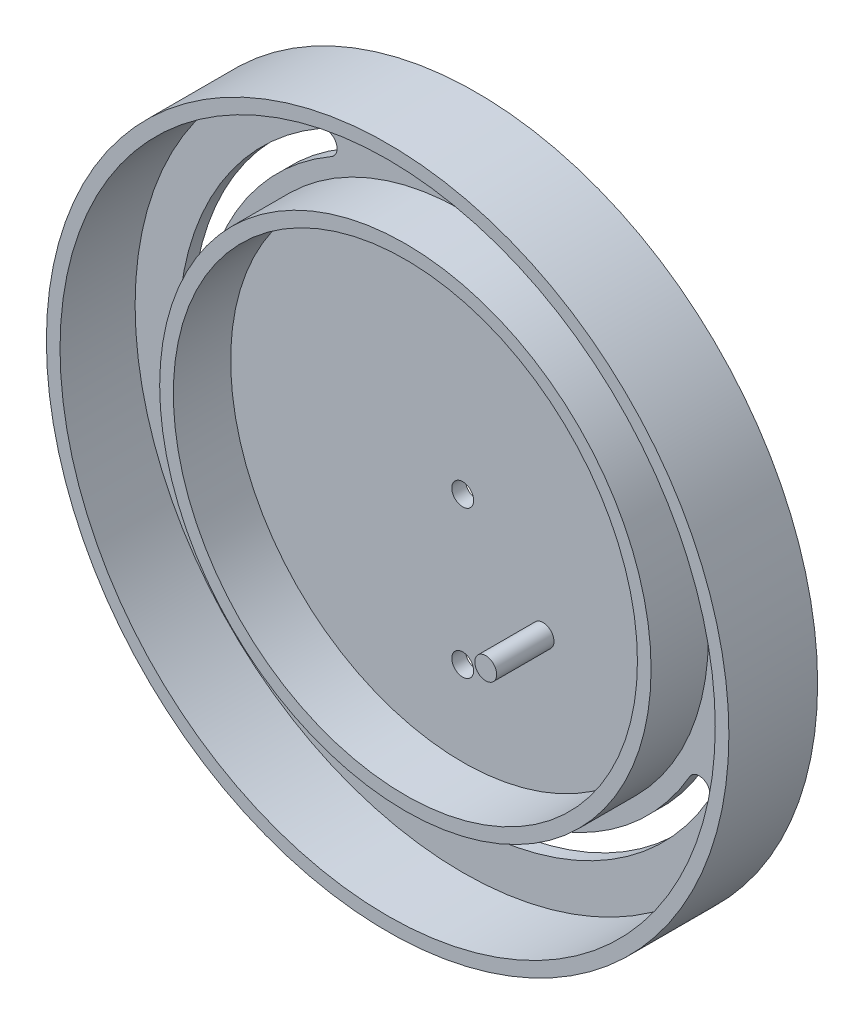
ISO-10303-21;
HEADER;
FILE_DESCRIPTION(('STEP AP214'),'2;1');
FILE_NAME('part.step','',(''),(''),'','','');
FILE_SCHEMA(('AUTOMOTIVE_DESIGN { 1 0 10303 214 1 1 1 1 }'));
ENDSEC;
DATA;
#1=APPLICATION_CONTEXT('core data for automotive mechanical design processes');
#2=APPLICATION_PROTOCOL_DEFINITION('international standard','automotive_design',2000,#1);
#3=PRODUCT_CONTEXT('',#1,'mechanical');
#4=PRODUCT('Part','Part','',(#3));
#5=PRODUCT_RELATED_PRODUCT_CATEGORY('part','',(#4));
#6=PRODUCT_DEFINITION_FORMATION('','',#4);
#7=PRODUCT_DEFINITION_CONTEXT('part definition',#1,'design');
#8=PRODUCT_DEFINITION('design','',#6,#7);
#9=PRODUCT_DEFINITION_SHAPE('','',#8);
#10=(LENGTH_UNIT() NAMED_UNIT(*) SI_UNIT(.MILLI.,.METRE.));
#11=(NAMED_UNIT(*) PLANE_ANGLE_UNIT() SI_UNIT($,.RADIAN.));
#12=(NAMED_UNIT(*) SI_UNIT($,.STERADIAN.) SOLID_ANGLE_UNIT());
#13=UNCERTAINTY_MEASURE_WITH_UNIT(LENGTH_MEASURE(1.E-05),#10,'distance_accuracy_value','');
#14=(GEOMETRIC_REPRESENTATION_CONTEXT(3) GLOBAL_UNCERTAINTY_ASSIGNED_CONTEXT((#13)) GLOBAL_UNIT_ASSIGNED_CONTEXT((#10,
#11,#12)) REPRESENTATION_CONTEXT('',''));
#15=CARTESIAN_POINT('',(0.,0.,0.));
#16=DIRECTION('',(0.,0.,1.));
#17=DIRECTION('',(1.,0.,0.));
#18=AXIS2_PLACEMENT_3D('',#15,#16,#17);
#19=CARTESIAN_POINT('',(0.,0.,1.25));
#20=DIRECTION('',(0.,0.,1.));
#21=DIRECTION('',(1.,0.,0.));
#22=AXIS2_PLACEMENT_3D('',#19,#20,#21);
#23=PLANE('',#22);
#24=CARTESIAN_POINT('',(0.,-27.,1.25));
#25=DIRECTION('',(0.,0.,1.));
#26=DIRECTION('',(1.,0.,0.));
#27=AXIS2_PLACEMENT_3D('',#24,#25,#26);
#28=CIRCLE('',#27,2.);
#29=CARTESIAN_POINT('',(2.,-27.,1.25));
#30=VERTEX_POINT('',#29);
#31=EDGE_CURVE('E218',#30,#30,#28,.T.);
#32=ORIENTED_EDGE('',*,*,#31,.F.);
#33=EDGE_LOOP('',(#32));
#34=FACE_BOUND('',#33,.T.);
#35=CARTESIAN_POINT('',(0.,0.,1.25));
#36=DIRECTION('',(0.,0.,1.));
#37=DIRECTION('',(1.,0.,0.));
#38=AXIS2_PLACEMENT_3D('',#35,#36,#37);
#39=CIRCLE('',#38,2.);
#40=CARTESIAN_POINT('',(2.,0.,1.25));
#41=VERTEX_POINT('',#40);
#42=EDGE_CURVE('E215',#41,#41,#39,.T.);
#43=ORIENTED_EDGE('',*,*,#42,.F.);
#44=EDGE_LOOP('',(#43));
#45=FACE_BOUND('',#44,.T.);
#46=CARTESIAN_POINT('',(14.7158150511627,-14.9814814814815,1.25));
#47=DIRECTION('',(0.,0.,1.));
#48=DIRECTION('',(1.,0.,0.));
#49=AXIS2_PLACEMENT_3D('',#46,#47,#48);
#50=CIRCLE('',#49,2.);
#51=CARTESIAN_POINT('',(16.7158150511627,-14.9814814814815,1.25));
#52=VERTEX_POINT('',#51);
#53=EDGE_CURVE('E181',#52,#52,#50,.F.);
#54=ORIENTED_EDGE('',*,*,#53,.T.);
#55=EDGE_LOOP('',(#54));
#56=FACE_BOUND('',#55,.T.);
#57=CARTESIAN_POINT('',(0.,0.,1.25));
#58=DIRECTION('',(0.,0.,1.));
#59=DIRECTION('',(1.,0.,0.));
#60=AXIS2_PLACEMENT_3D('',#57,#58,#59);
#61=CIRCLE('',#60,42.5);
#62=CARTESIAN_POINT('',(42.5,0.,1.25));
#63=VERTEX_POINT('',#62);
#64=EDGE_CURVE('E12',#63,#63,#61,.F.);
#65=ORIENTED_EDGE('',*,*,#64,.F.);
#66=EDGE_LOOP('',(#65));
#67=FACE_BOUND('',#66,.T.);
#68=ADVANCED_FACE('F67',(#34,#45,#56,#67),#23,.T.);
#69=CARTESIAN_POINT('',(0.,50.,-1.25));
#70=DIRECTION('',(0.,0.,1.));
#71=DIRECTION('',(1.,0.,0.));
#72=AXIS2_PLACEMENT_3D('',#69,#70,#71);
#73=CYLINDRICAL_SURFACE('',#72,2.);
#74=DIRECTION('',(0.,0.,1.));
#75=VECTOR('',#74,1.);
#76=CARTESIAN_POINT('',(0.,52.,-1.25));
#77=LINE('',#76,#75);
#78=CARTESIAN_POINT('',(0.,52.,-1.25));
#79=VERTEX_POINT('',#78);
#80=CARTESIAN_POINT('',(0.,52.,1.25));
#81=VERTEX_POINT('',#80);
#82=EDGE_CURVE('E254',#79,#81,#77,.T.);
#83=ORIENTED_EDGE('',*,*,#82,.T.);
#84=CARTESIAN_POINT('',(0.,50.,1.25));
#85=DIRECTION('',(0.,0.,1.));
#86=DIRECTION('',(1.,0.,0.));
#87=AXIS2_PLACEMENT_3D('',#84,#85,#86);
#88=CIRCLE('',#87,2.);
#89=CARTESIAN_POINT('',(0.,48.,1.25));
#90=VERTEX_POINT('',#89);
#91=EDGE_CURVE('E203',#81,#90,#88,.T.);
#92=ORIENTED_EDGE('',*,*,#91,.T.);
#93=DIRECTION('',(0.,0.,1.));
#94=VECTOR('',#93,1.);
#95=CARTESIAN_POINT('',(0.,48.,-1.25));
#96=LINE('',#95,#94);
#97=CARTESIAN_POINT('',(0.,48.,-1.25));
#98=VERTEX_POINT('',#97);
#99=EDGE_CURVE('E76',#98,#90,#96,.T.);
#100=ORIENTED_EDGE('',*,*,#99,.F.);
#101=CARTESIAN_POINT('',(0.,50.,-1.25));
#102=DIRECTION('',(0.,0.,1.));
#103=DIRECTION('',(1.,0.,0.));
#104=AXIS2_PLACEMENT_3D('',#101,#102,#103);
#105=CIRCLE('',#104,2.);
#106=EDGE_CURVE('E83',#79,#98,#105,.T.);
#107=ORIENTED_EDGE('',*,*,#106,.F.);
#108=EDGE_LOOP('',(#83,#92,#100,#107));
#109=FACE_BOUND('',#108,.T.);
#110=ADVANCED_FACE('F310',(#109),#73,.F.);
#111=CARTESIAN_POINT('',(0.,0.,-1.25));
#112=DIRECTION('',(0.,0.,1.));
#113=DIRECTION('',(1.,0.,0.));
#114=AXIS2_PLACEMENT_3D('',#111,#112,#113);
#115=CYLINDRICAL_SURFACE('',#114,48.);
#116=ORIENTED_EDGE('',*,*,#99,.T.);
#117=CARTESIAN_POINT('',(0.,0.,1.25));
#118=DIRECTION('',(0.,0.,1.));
#119=DIRECTION('',(1.,0.,0.));
#120=AXIS2_PLACEMENT_3D('',#117,#118,#119);
#121=CIRCLE('',#120,48.);
#122=CARTESIAN_POINT('',(48.,0.,1.25));
#123=VERTEX_POINT('',#122);
#124=EDGE_CURVE('E212',#123,#90,#121,.T.);
#125=ORIENTED_EDGE('',*,*,#124,.F.);
#126=DIRECTION('',(0.,0.,1.));
#127=VECTOR('',#126,1.);
#128=CARTESIAN_POINT('',(48.,0.,-1.25));
#129=LINE('',#128,#127);
#130=CARTESIAN_POINT('',(48.,0.,-1.25));
#131=VERTEX_POINT('',#130);
#132=EDGE_CURVE('E91',#131,#123,#129,.T.);
#133=ORIENTED_EDGE('',*,*,#132,.F.);
#134=CARTESIAN_POINT('',(0.,0.,-1.25));
#135=DIRECTION('',(0.,0.,1.));
#136=DIRECTION('',(1.,0.,0.));
#137=AXIS2_PLACEMENT_3D('',#134,#135,#136);
#138=CIRCLE('',#137,48.);
#139=EDGE_CURVE('E243',#131,#98,#138,.T.);
#140=ORIENTED_EDGE('',*,*,#139,.T.);
#141=EDGE_LOOP('',(#116,#125,#133,#140));
#142=FACE_BOUND('',#141,.T.);
#143=ADVANCED_FACE('F316',(#142),#115,.T.);
#144=CARTESIAN_POINT('',(50.,0.,-1.25));
#145=DIRECTION('',(0.,0.,1.));
#146=DIRECTION('',(1.,0.,0.));
#147=AXIS2_PLACEMENT_3D('',#144,#145,#146);
#148=CYLINDRICAL_SURFACE('',#147,2.);
#149=ORIENTED_EDGE('',*,*,#132,.T.);
#150=CARTESIAN_POINT('',(50.,0.,1.25));
#151=DIRECTION('',(0.,0.,1.));
#152=DIRECTION('',(1.,0.,0.));
#153=AXIS2_PLACEMENT_3D('',#150,#151,#152);
#154=CIRCLE('',#153,2.);
#155=CARTESIAN_POINT('',(52.,0.,1.25));
#156=VERTEX_POINT('',#155);
#157=EDGE_CURVE('E209',#123,#156,#154,.T.);
#158=ORIENTED_EDGE('',*,*,#157,.T.);
#159=DIRECTION('',(0.,0.,1.));
#160=VECTOR('',#159,1.);
#161=CARTESIAN_POINT('',(52.,0.,-1.25));
#162=LINE('',#161,#160);
#163=CARTESIAN_POINT('',(52.,0.,-1.25));
#164=VERTEX_POINT('',#163);
#165=EDGE_CURVE('E252',#164,#156,#162,.T.);
#166=ORIENTED_EDGE('',*,*,#165,.F.);
#167=CARTESIAN_POINT('',(50.,0.,-1.25));
#168=DIRECTION('',(0.,0.,1.));
#169=DIRECTION('',(1.,0.,0.));
#170=AXIS2_PLACEMENT_3D('',#167,#168,#169);
#171=CIRCLE('',#170,2.);
#172=EDGE_CURVE('E241',#131,#164,#171,.T.);
#173=ORIENTED_EDGE('',*,*,#172,.F.);
#174=EDGE_LOOP('',(#149,#158,#166,#173));
#175=FACE_BOUND('',#174,.T.);
#176=ADVANCED_FACE('F481',(#175),#148,.F.);
#177=CARTESIAN_POINT('',(43.3012701892219,-25.,-1.25));
#178=DIRECTION('',(0.,0.,1.));
#179=DIRECTION('',(1.,0.,0.));
#180=AXIS2_PLACEMENT_3D('',#177,#178,#179);
#181=CYLINDRICAL_SURFACE('',#180,2.);
#182=DIRECTION('',(0.,0.,1.));
#183=VECTOR('',#182,1.);
#184=CARTESIAN_POINT('',(45.0333209967908,-26.,-1.25));
#185=LINE('',#184,#183);
#186=CARTESIAN_POINT('',(45.0333209967908,-26.,-1.25));
#187=VERTEX_POINT('',#186);
#188=CARTESIAN_POINT('',(45.0333209967908,-26.,1.25));
#189=VERTEX_POINT('',#188);
#190=EDGE_CURVE('E262',#187,#189,#185,.T.);
#191=ORIENTED_EDGE('',*,*,#190,.T.);
#192=CARTESIAN_POINT('',(43.3012701892219,-25.,1.25));
#193=DIRECTION('',(0.,0.,1.));
#194=DIRECTION('',(1.,0.,0.));
#195=AXIS2_PLACEMENT_3D('',#192,#193,#194);
#196=CIRCLE('',#195,2.);
#197=CARTESIAN_POINT('',(41.569219381653,-24.,1.25));
#198=VERTEX_POINT('',#197);
#199=EDGE_CURVE('E191',#189,#198,#196,.T.);
#200=ORIENTED_EDGE('',*,*,#199,.T.);
#201=DIRECTION('',(0.,0.,1.));
#202=VECTOR('',#201,1.);
#203=CARTESIAN_POINT('',(41.569219381653,-24.,-1.25));
#204=LINE('',#203,#202);
#205=CARTESIAN_POINT('',(41.569219381653,-24.,-1.25));
#206=VERTEX_POINT('',#205);
#207=EDGE_CURVE('E256',#206,#198,#204,.T.);
#208=ORIENTED_EDGE('',*,*,#207,.F.);
#209=CARTESIAN_POINT('',(43.3012701892219,-25.,-1.25));
#210=DIRECTION('',(0.,0.,1.));
#211=DIRECTION('',(1.,0.,0.));
#212=AXIS2_PLACEMENT_3D('',#209,#210,#211);
#213=CIRCLE('',#212,2.);
#214=EDGE_CURVE('E229',#187,#206,#213,.T.);
#215=ORIENTED_EDGE('',*,*,#214,.F.);
#216=EDGE_LOOP('',(#191,#200,#208,#215));
#217=FACE_BOUND('',#216,.T.);
#218=ADVANCED_FACE('F473',(#217),#181,.F.);
#219=CARTESIAN_POINT('',(0.,0.,-1.25));
#220=DIRECTION('',(0.,0.,1.));
#221=DIRECTION('',(1.,0.,0.));
#222=AXIS2_PLACEMENT_3D('',#219,#220,#221);
#223=CYLINDRICAL_SURFACE('',#222,48.);
#224=ORIENTED_EDGE('',*,*,#207,.T.);
#225=CARTESIAN_POINT('',(0.,0.,1.25));
#226=DIRECTION('',(0.,0.,1.));
#227=DIRECTION('',(1.,0.,0.));
#228=AXIS2_PLACEMENT_3D('',#225,#226,#227);
#229=CIRCLE('',#228,48.);
#230=CARTESIAN_POINT('',(-24.,-41.569219381653,1.25));
#231=VERTEX_POINT('',#230);
#232=EDGE_CURVE('E200',#231,#198,#229,.T.);
#233=ORIENTED_EDGE('',*,*,#232,.F.);
#234=DIRECTION('',(0.,0.,1.));
#235=VECTOR('',#234,1.);
#236=CARTESIAN_POINT('',(-24.,-41.569219381653,-1.25));
#237=LINE('',#236,#235);
#238=CARTESIAN_POINT('',(-24.,-41.569219381653,-1.25));
#239=VERTEX_POINT('',#238);
#240=EDGE_CURVE('E258',#239,#231,#237,.T.);
#241=ORIENTED_EDGE('',*,*,#240,.F.);
#242=CARTESIAN_POINT('',(0.,0.,-1.25));
#243=DIRECTION('',(0.,0.,1.));
#244=DIRECTION('',(1.,0.,0.));
#245=AXIS2_PLACEMENT_3D('',#242,#243,#244);
#246=CIRCLE('',#245,48.);
#247=EDGE_CURVE('E235',#239,#206,#246,.T.);
#248=ORIENTED_EDGE('',*,*,#247,.T.);
#249=EDGE_LOOP('',(#224,#233,#241,#248));
#250=FACE_BOUND('',#249,.T.);
#251=ADVANCED_FACE('F465',(#250),#223,.T.);
#252=CARTESIAN_POINT('',(-25.,-43.3012701892219,-1.25));
#253=DIRECTION('',(0.,0.,1.));
#254=DIRECTION('',(1.,0.,0.));
#255=AXIS2_PLACEMENT_3D('',#252,#253,#254);
#256=CYLINDRICAL_SURFACE('',#255,1.99999999999999);
#257=ORIENTED_EDGE('',*,*,#240,.T.);
#258=CARTESIAN_POINT('',(-25.,-43.3012701892219,1.25));
#259=DIRECTION('',(0.,0.,1.));
#260=DIRECTION('',(1.,0.,0.));
#261=AXIS2_PLACEMENT_3D('',#258,#259,#260);
#262=CIRCLE('',#261,1.99999999999999);
#263=CARTESIAN_POINT('',(-26.,-45.0333209967907,1.25));
#264=VERTEX_POINT('',#263);
#265=EDGE_CURVE('E197',#231,#264,#262,.T.);
#266=ORIENTED_EDGE('',*,*,#265,.T.);
#267=DIRECTION('',(0.,0.,1.));
#268=VECTOR('',#267,1.);
#269=CARTESIAN_POINT('',(-26.,-45.0333209967907,-1.25));
#270=LINE('',#269,#268);
#271=CARTESIAN_POINT('',(-26.,-45.0333209967907,-1.25));
#272=VERTEX_POINT('',#271);
#273=EDGE_CURVE('E260',#272,#264,#270,.T.);
#274=ORIENTED_EDGE('',*,*,#273,.F.);
#275=CARTESIAN_POINT('',(-25.,-43.3012701892219,-1.25));
#276=DIRECTION('',(0.,0.,1.));
#277=DIRECTION('',(1.,0.,0.));
#278=AXIS2_PLACEMENT_3D('',#275,#276,#277);
#279=CIRCLE('',#278,1.99999999999999);
#280=EDGE_CURVE('E233',#239,#272,#279,.T.);
#281=ORIENTED_EDGE('',*,*,#280,.F.);
#282=EDGE_LOOP('',(#257,#266,#274,#281));
#283=FACE_BOUND('',#282,.T.);
#284=ADVANCED_FACE('F459',(#283),#256,.F.);
#285=CARTESIAN_POINT('',(-43.3012701892219,-24.9999999999999,-1.25));
#286=DIRECTION('',(0.,0.,1.));
#287=DIRECTION('',(1.,0.,0.));
#288=AXIS2_PLACEMENT_3D('',#285,#286,#287);
#289=CYLINDRICAL_SURFACE('',#288,2.);
#290=DIRECTION('',(0.,0.,1.));
#291=VECTOR('',#290,1.);
#292=CARTESIAN_POINT('',(-45.0333209967908,-25.9999999999999,-1.25));
#293=LINE('',#292,#291);
#294=CARTESIAN_POINT('',(-45.0333209967908,-25.9999999999999,-1.25));
#295=VERTEX_POINT('',#294);
#296=CARTESIAN_POINT('',(-45.0333209967908,-25.9999999999999,1.25));
#297=VERTEX_POINT('',#296);
#298=EDGE_CURVE('E160',#295,#297,#293,.T.);
#299=ORIENTED_EDGE('',*,*,#298,.T.);
#300=CARTESIAN_POINT('',(-43.3012701892219,-24.9999999999999,1.25));
#301=DIRECTION('',(0.,0.,1.));
#302=DIRECTION('',(1.,0.,0.));
#303=AXIS2_PLACEMENT_3D('',#300,#301,#302);
#304=CIRCLE('',#303,2.);
#305=CARTESIAN_POINT('',(-41.5692193816531,-23.9999999999999,1.25));
#306=VERTEX_POINT('',#305);
#307=EDGE_CURVE('E163',#297,#306,#304,.T.);
#308=ORIENTED_EDGE('',*,*,#307,.T.);
#309=DIRECTION('',(0.,0.,1.));
#310=VECTOR('',#309,1.);
#311=CARTESIAN_POINT('',(-41.5692193816531,-23.9999999999999,-1.25));
#312=LINE('',#311,#310);
#313=CARTESIAN_POINT('',(-41.5692193816531,-23.9999999999999,-1.25));
#314=VERTEX_POINT('',#313);
#315=EDGE_CURVE('E264',#314,#306,#312,.T.);
#316=ORIENTED_EDGE('',*,*,#315,.F.);
#317=CARTESIAN_POINT('',(-43.3012701892219,-24.9999999999999,-1.25));
#318=DIRECTION('',(0.,0.,1.));
#319=DIRECTION('',(1.,0.,0.));
#320=AXIS2_PLACEMENT_3D('',#317,#318,#319);
#321=CIRCLE('',#320,2.);
#322=EDGE_CURVE('E164',#295,#314,#321,.T.);
#323=ORIENTED_EDGE('',*,*,#322,.F.);
#324=EDGE_LOOP('',(#299,#308,#316,#323));
#325=FACE_BOUND('',#324,.T.);
#326=ADVANCED_FACE('F69',(#325),#289,.F.);
#327=CARTESIAN_POINT('',(0.,0.,-1.25));
#328=DIRECTION('',(0.,0.,1.));
#329=DIRECTION('',(1.,0.,0.));
#330=AXIS2_PLACEMENT_3D('',#327,#328,#329);
#331=CYLINDRICAL_SURFACE('',#330,48.);
#332=ORIENTED_EDGE('',*,*,#315,.T.);
#333=CARTESIAN_POINT('',(0.,0.,1.25));
#334=DIRECTION('',(0.,0.,1.));
#335=DIRECTION('',(1.,0.,0.));
#336=AXIS2_PLACEMENT_3D('',#333,#334,#335);
#337=CIRCLE('',#336,48.);
#338=CARTESIAN_POINT('',(-23.9999999999999,41.5692193816531,1.25));
#339=VERTEX_POINT('',#338);
#340=EDGE_CURVE('E180',#339,#306,#337,.T.);
#341=ORIENTED_EDGE('',*,*,#340,.F.);
#342=DIRECTION('',(0.,0.,1.));
#343=VECTOR('',#342,1.);
#344=CARTESIAN_POINT('',(-23.9999999999999,41.5692193816531,-1.25));
#345=LINE('',#344,#343);
#346=CARTESIAN_POINT('',(-23.9999999999999,41.5692193816531,-1.25));
#347=VERTEX_POINT('',#346);
#348=EDGE_CURVE('E266',#347,#339,#345,.T.);
#349=ORIENTED_EDGE('',*,*,#348,.F.);
#350=CARTESIAN_POINT('',(0.,0.,-1.25));
#351=DIRECTION('',(0.,0.,1.));
#352=DIRECTION('',(1.,0.,0.));
#353=AXIS2_PLACEMENT_3D('',#350,#351,#352);
#354=CIRCLE('',#353,48.);
#355=EDGE_CURVE('E226',#347,#314,#354,.T.);
#356=ORIENTED_EDGE('',*,*,#355,.T.);
#357=EDGE_LOOP('',(#332,#341,#349,#356));
#358=FACE_BOUND('',#357,.T.);
#359=ADVANCED_FACE('F444',(#358),#331,.T.);
#360=CARTESIAN_POINT('',(-24.9999999999999,43.301270189222,-1.25));
#361=DIRECTION('',(0.,0.,1.));
#362=DIRECTION('',(1.,0.,0.));
#363=AXIS2_PLACEMENT_3D('',#360,#361,#362);
#364=CYLINDRICAL_SURFACE('',#363,1.99999999999999);
#365=ORIENTED_EDGE('',*,*,#348,.T.);
#366=CARTESIAN_POINT('',(-24.9999999999999,43.301270189222,1.25));
#367=DIRECTION('',(0.,0.,1.));
#368=DIRECTION('',(1.,0.,0.));
#369=AXIS2_PLACEMENT_3D('',#366,#367,#368);
#370=CIRCLE('',#369,1.99999999999999);
#371=CARTESIAN_POINT('',(-25.9999999999999,45.0333209967908,1.25));
#372=VERTEX_POINT('',#371);
#373=EDGE_CURVE('E185',#339,#372,#370,.T.);
#374=ORIENTED_EDGE('',*,*,#373,.T.);
#375=DIRECTION('',(0.,0.,1.));
#376=VECTOR('',#375,1.);
#377=CARTESIAN_POINT('',(-25.9999999999999,45.0333209967908,-1.25));
#378=LINE('',#377,#376);
#379=CARTESIAN_POINT('',(-25.9999999999999,45.0333209967908,-1.25));
#380=VERTEX_POINT('',#379);
#381=EDGE_CURVE('E168',#380,#372,#378,.T.);
#382=ORIENTED_EDGE('',*,*,#381,.F.);
#383=CARTESIAN_POINT('',(-24.9999999999999,43.301270189222,-1.25));
#384=DIRECTION('',(0.,0.,1.));
#385=DIRECTION('',(1.,0.,0.));
#386=AXIS2_PLACEMENT_3D('',#383,#384,#385);
#387=CIRCLE('',#386,1.99999999999999);
#388=EDGE_CURVE('E224',#347,#380,#387,.T.);
#389=ORIENTED_EDGE('',*,*,#388,.F.);
#390=EDGE_LOOP('',(#365,#374,#382,#389));
#391=FACE_BOUND('',#390,.T.);
#392=ADVANCED_FACE('F436',(#391),#364,.F.);
#393=CARTESIAN_POINT('',(0.,0.,-1.25));
#394=DIRECTION('',(0.,0.,1.));
#395=DIRECTION('',(1.,0.,0.));
#396=AXIS2_PLACEMENT_3D('',#393,#394,#395);
#397=CYLINDRICAL_SURFACE('',#396,2.);
#398=CARTESIAN_POINT('',(0.,0.,-1.25));
#399=DIRECTION('',(0.,0.,1.));
#400=DIRECTION('',(1.,0.,0.));
#401=AXIS2_PLACEMENT_3D('',#398,#399,#400);
#402=CIRCLE('',#401,2.);
#403=CARTESIAN_POINT('',(2.,0.,-1.25));
#404=VERTEX_POINT('',#403);
#405=EDGE_CURVE('E245',#404,#404,#402,.T.);
#406=ORIENTED_EDGE('',*,*,#405,.F.);
#407=EDGE_LOOP('',(#406));
#408=FACE_BOUND('',#407,.T.);
#409=ORIENTED_EDGE('',*,*,#42,.T.);
#410=EDGE_LOOP('',(#409));
#411=FACE_BOUND('',#410,.T.);
#412=ADVANCED_FACE('F428',(#408,#411),#397,.F.);
#413=CARTESIAN_POINT('',(0.,0.,-1.25));
#414=DIRECTION('',(0.,0.,1.));
#415=DIRECTION('',(1.,0.,0.));
#416=AXIS2_PLACEMENT_3D('',#413,#414,#415);
#417=CYLINDRICAL_SURFACE('',#416,52.);
#418=ORIENTED_EDGE('',*,*,#165,.T.);
#419=CARTESIAN_POINT('',(0.,0.,1.25));
#420=DIRECTION('',(0.,0.,1.));
#421=DIRECTION('',(1.,0.,0.));
#422=AXIS2_PLACEMENT_3D('',#419,#420,#421);
#423=CIRCLE('',#422,52.);
#424=EDGE_CURVE('E206',#156,#81,#423,.T.);
#425=ORIENTED_EDGE('',*,*,#424,.T.);
#426=ORIENTED_EDGE('',*,*,#82,.F.);
#427=CARTESIAN_POINT('',(0.,0.,-1.25));
#428=DIRECTION('',(0.,0.,1.));
#429=DIRECTION('',(1.,0.,0.));
#430=AXIS2_PLACEMENT_3D('',#427,#428,#429);
#431=CIRCLE('',#430,52.);
#432=EDGE_CURVE('E239',#164,#79,#431,.T.);
#433=ORIENTED_EDGE('',*,*,#432,.F.);
#434=EDGE_LOOP('',(#418,#425,#426,#433));
#435=FACE_BOUND('',#434,.T.);
#436=ADVANCED_FACE('F420',(#435),#417,.F.);
#437=CARTESIAN_POINT('',(0.,0.,-1.25));
#438=DIRECTION('',(0.,0.,1.));
#439=DIRECTION('',(1.,0.,0.));
#440=AXIS2_PLACEMENT_3D('',#437,#438,#439);
#441=CYLINDRICAL_SURFACE('',#440,52.);
#442=ORIENTED_EDGE('',*,*,#273,.T.);
#443=CARTESIAN_POINT('',(0.,0.,1.25));
#444=DIRECTION('',(0.,0.,1.));
#445=DIRECTION('',(1.,0.,0.));
#446=AXIS2_PLACEMENT_3D('',#443,#444,#445);
#447=CIRCLE('',#446,52.);
#448=EDGE_CURVE('E194',#264,#189,#447,.T.);
#449=ORIENTED_EDGE('',*,*,#448,.T.);
#450=ORIENTED_EDGE('',*,*,#190,.F.);
#451=CARTESIAN_POINT('',(0.,0.,-1.25));
#452=DIRECTION('',(0.,0.,1.));
#453=DIRECTION('',(1.,0.,0.));
#454=AXIS2_PLACEMENT_3D('',#451,#452,#453);
#455=CIRCLE('',#454,52.);
#456=EDGE_CURVE('E231',#272,#187,#455,.T.);
#457=ORIENTED_EDGE('',*,*,#456,.F.);
#458=EDGE_LOOP('',(#442,#449,#450,#457));
#459=FACE_BOUND('',#458,.T.);
#460=ADVANCED_FACE('F414',(#459),#441,.F.);
#461=CARTESIAN_POINT('',(0.,0.,-1.25));
#462=DIRECTION('',(0.,0.,1.));
#463=DIRECTION('',(1.,0.,0.));
#464=AXIS2_PLACEMENT_3D('',#461,#462,#463);
#465=CYLINDRICAL_SURFACE('',#464,52.);
#466=ORIENTED_EDGE('',*,*,#381,.T.);
#467=CARTESIAN_POINT('',(0.,0.,1.25));
#468=DIRECTION('',(0.,0.,1.));
#469=DIRECTION('',(1.,0.,0.));
#470=AXIS2_PLACEMENT_3D('',#467,#468,#469);
#471=CIRCLE('',#470,52.);
#472=EDGE_CURVE('E177',#372,#297,#471,.T.);
#473=ORIENTED_EDGE('',*,*,#472,.T.);
#474=ORIENTED_EDGE('',*,*,#298,.F.);
#475=CARTESIAN_POINT('',(0.,0.,-1.25));
#476=DIRECTION('',(0.,0.,1.));
#477=DIRECTION('',(1.,0.,0.));
#478=AXIS2_PLACEMENT_3D('',#475,#476,#477);
#479=CIRCLE('',#478,52.);
#480=EDGE_CURVE('E222',#380,#295,#479,.T.);
#481=ORIENTED_EDGE('',*,*,#480,.F.);
#482=EDGE_LOOP('',(#466,#473,#474,#481));
#483=FACE_BOUND('',#482,.T.);
#484=ADVANCED_FACE('F183',(#483),#465,.F.);
#485=CARTESIAN_POINT('',(0.,-27.,-1.25));
#486=DIRECTION('',(0.,0.,1.));
#487=DIRECTION('',(1.,0.,0.));
#488=AXIS2_PLACEMENT_3D('',#485,#486,#487);
#489=CYLINDRICAL_SURFACE('',#488,2.);
#490=CARTESIAN_POINT('',(0.,-27.,-1.25));
#491=DIRECTION('',(0.,0.,1.));
#492=DIRECTION('',(1.,0.,0.));
#493=AXIS2_PLACEMENT_3D('',#490,#491,#492);
#494=CIRCLE('',#493,2.);
#495=CARTESIAN_POINT('',(2.,-27.,-1.25));
#496=VERTEX_POINT('',#495);
#497=EDGE_CURVE('E169',#496,#496,#494,.T.);
#498=ORIENTED_EDGE('',*,*,#497,.F.);
#499=EDGE_LOOP('',(#498));
#500=FACE_BOUND('',#499,.T.);
#501=ORIENTED_EDGE('',*,*,#31,.T.);
#502=EDGE_LOOP('',(#501));
#503=FACE_BOUND('',#502,.T.);
#504=ADVANCED_FACE('F333',(#500,#503),#489,.F.);
#505=CARTESIAN_POINT('',(0.,0.,-1.25));
#506=DIRECTION('',(0.,0.,1.));
#507=DIRECTION('',(1.,0.,0.));
#508=AXIS2_PLACEMENT_3D('',#505,#506,#507);
#509=PLANE('',#508);
#510=ORIENTED_EDGE('',*,*,#322,.T.);
#511=ORIENTED_EDGE('',*,*,#355,.F.);
#512=ORIENTED_EDGE('',*,*,#388,.T.);
#513=ORIENTED_EDGE('',*,*,#480,.T.);
#514=EDGE_LOOP('',(#510,#511,#512,#513));
#515=FACE_BOUND('',#514,.T.);
#516=ORIENTED_EDGE('',*,*,#214,.T.);
#517=ORIENTED_EDGE('',*,*,#247,.F.);
#518=ORIENTED_EDGE('',*,*,#280,.T.);
#519=ORIENTED_EDGE('',*,*,#456,.T.);
#520=EDGE_LOOP('',(#516,#517,#518,#519));
#521=FACE_BOUND('',#520,.T.);
#522=ORIENTED_EDGE('',*,*,#106,.T.);
#523=ORIENTED_EDGE('',*,*,#139,.F.);
#524=ORIENTED_EDGE('',*,*,#172,.T.);
#525=ORIENTED_EDGE('',*,*,#432,.T.);
#526=EDGE_LOOP('',(#522,#523,#524,#525));
#527=FACE_BOUND('',#526,.T.);
#528=ORIENTED_EDGE('',*,*,#405,.T.);
#529=EDGE_LOOP('',(#528));
#530=FACE_BOUND('',#529,.T.);
#531=ORIENTED_EDGE('',*,*,#497,.T.);
#532=EDGE_LOOP('',(#531));
#533=FACE_BOUND('',#532,.T.);
#534=CARTESIAN_POINT('',(0.,0.,-1.25));
#535=DIRECTION('',(0.,0.,1.));
#536=DIRECTION('',(1.,0.,0.));
#537=AXIS2_PLACEMENT_3D('',#534,#535,#536);
#538=CIRCLE('',#537,62.5);
#539=CARTESIAN_POINT('',(62.5,0.,-1.25));
#540=VERTEX_POINT('',#539);
#541=EDGE_CURVE('E287',#540,#540,#538,.T.);
#542=ORIENTED_EDGE('',*,*,#541,.F.);
#543=EDGE_LOOP('',(#542));
#544=FACE_BOUND('',#543,.T.);
#545=ADVANCED_FACE('F325',(#515,#521,#527,#530,#533,#544),#509,.F.);
#546=CARTESIAN_POINT('',(0.,0.,1.25));
#547=DIRECTION('',(0.,0.,1.));
#548=DIRECTION('',(1.,0.,0.));
#549=AXIS2_PLACEMENT_3D('',#546,#547,#548);
#550=CIRCLE('',#549,45.);
#551=CARTESIAN_POINT('',(45.,0.,1.25));
#552=VERTEX_POINT('',#551);
#553=EDGE_CURVE('E71',#552,#552,#550,.F.);
#554=ORIENTED_EDGE('',*,*,#553,.T.);
#555=EDGE_LOOP('',(#554));
#556=FACE_BOUND('',#555,.T.);
#557=ORIENTED_EDGE('',*,*,#307,.F.);
#558=ORIENTED_EDGE('',*,*,#472,.F.);
#559=ORIENTED_EDGE('',*,*,#373,.F.);
#560=ORIENTED_EDGE('',*,*,#340,.T.);
#561=EDGE_LOOP('',(#557,#558,#559,#560));
#562=FACE_BOUND('',#561,.T.);
#563=ORIENTED_EDGE('',*,*,#199,.F.);
#564=ORIENTED_EDGE('',*,*,#448,.F.);
#565=ORIENTED_EDGE('',*,*,#265,.F.);
#566=ORIENTED_EDGE('',*,*,#232,.T.);
#567=EDGE_LOOP('',(#563,#564,#565,#566));
#568=FACE_BOUND('',#567,.T.);
#569=ORIENTED_EDGE('',*,*,#91,.F.);
#570=ORIENTED_EDGE('',*,*,#424,.F.);
#571=ORIENTED_EDGE('',*,*,#157,.F.);
#572=ORIENTED_EDGE('',*,*,#124,.T.);
#573=EDGE_LOOP('',(#569,#570,#571,#572));
#574=FACE_BOUND('',#573,.T.);
#575=CARTESIAN_POINT('',(0.,0.,1.25));
#576=DIRECTION('',(0.,0.,1.));
#577=DIRECTION('',(1.,0.,0.));
#578=AXIS2_PLACEMENT_3D('',#575,#576,#577);
#579=CIRCLE('',#578,60.);
#580=CARTESIAN_POINT('',(60.,0.,1.25));
#581=VERTEX_POINT('',#580);
#582=EDGE_CURVE('E284',#581,#581,#579,.T.);
#583=ORIENTED_EDGE('',*,*,#582,.T.);
#584=EDGE_LOOP('',(#583));
#585=FACE_BOUND('',#584,.T.);
#586=ADVANCED_FACE('F174',(#556,#562,#568,#574,#585),#23,.T.);
#587=CARTESIAN_POINT('',(14.7158150511627,-14.9814814814815,11.75));
#588=DIRECTION('',(0.,0.,-1.));
#589=DIRECTION('',(-1.,0.,0.));
#590=AXIS2_PLACEMENT_3D('',#587,#588,#589);
#591=CYLINDRICAL_SURFACE('',#590,2.);
#592=ORIENTED_EDGE('',*,*,#53,.F.);
#593=EDGE_LOOP('',(#592));
#594=FACE_BOUND('',#593,.T.);
#595=CARTESIAN_POINT('',(14.7158150511627,-14.9814814814815,11.75));
#596=DIRECTION('',(0.,0.,1.));
#597=DIRECTION('',(1.,0.,0.));
#598=AXIS2_PLACEMENT_3D('',#595,#596,#597);
#599=CIRCLE('',#598,2.);
#600=CARTESIAN_POINT('',(16.7158150511627,-14.9814814814815,11.75));
#601=VERTEX_POINT('',#600);
#602=EDGE_CURVE('E270',#601,#601,#599,.T.);
#603=ORIENTED_EDGE('',*,*,#602,.F.);
#604=EDGE_LOOP('',(#603));
#605=FACE_BOUND('',#604,.T.);
#606=ADVANCED_FACE('F324',(#594,#605),#591,.T.);
#607=CARTESIAN_POINT('',(14.7158150511627,-14.9814814814815,11.75));
#608=DIRECTION('',(0.,0.,1.));
#609=DIRECTION('',(1.,0.,0.));
#610=AXIS2_PLACEMENT_3D('',#607,#608,#609);
#611=PLANE('',#610);
#612=ORIENTED_EDGE('',*,*,#602,.T.);
#613=EDGE_LOOP('',(#612));
#614=FACE_BOUND('',#613,.T.);
#615=ADVANCED_FACE('F331',(#614),#611,.T.);
#616=CARTESIAN_POINT('',(0.,0.,11.75));
#617=DIRECTION('',(0.,0.,1.));
#618=DIRECTION('',(1.,0.,0.));
#619=AXIS2_PLACEMENT_3D('',#616,#617,#618);
#620=PLANE('',#619);
#621=CARTESIAN_POINT('',(0.,0.,11.75));
#622=DIRECTION('',(0.,0.,1.));
#623=DIRECTION('',(1.,0.,0.));
#624=AXIS2_PLACEMENT_3D('',#621,#622,#623);
#625=CIRCLE('',#624,45.);
#626=CARTESIAN_POINT('',(45.,0.,11.75));
#627=VERTEX_POINT('',#626);
#628=EDGE_CURVE('E281',#627,#627,#625,.T.);
#629=ORIENTED_EDGE('',*,*,#628,.T.);
#630=EDGE_LOOP('',(#629));
#631=FACE_BOUND('',#630,.T.);
#632=CARTESIAN_POINT('',(0.,0.,11.75));
#633=DIRECTION('',(0.,0.,1.));
#634=DIRECTION('',(1.,0.,0.));
#635=AXIS2_PLACEMENT_3D('',#632,#633,#634);
#636=CIRCLE('',#635,42.5);
#637=CARTESIAN_POINT('',(42.5,0.,11.75));
#638=VERTEX_POINT('',#637);
#639=EDGE_CURVE('E277',#638,#638,#636,.T.);
#640=ORIENTED_EDGE('',*,*,#639,.F.);
#641=EDGE_LOOP('',(#640));
#642=FACE_BOUND('',#641,.T.);
#643=ADVANCED_FACE('F341',(#631,#642),#620,.T.);
#644=CARTESIAN_POINT('',(0.,0.,11.75));
#645=DIRECTION('',(0.,0.,-1.));
#646=DIRECTION('',(-1.,0.,0.));
#647=AXIS2_PLACEMENT_3D('',#644,#645,#646);
#648=CYLINDRICAL_SURFACE('',#647,45.);
#649=ORIENTED_EDGE('',*,*,#553,.F.);
#650=EDGE_LOOP('',(#649));
#651=FACE_BOUND('',#650,.T.);
#652=ORIENTED_EDGE('',*,*,#628,.F.);
#653=EDGE_LOOP('',(#652));
#654=FACE_BOUND('',#653,.T.);
#655=ADVANCED_FACE('F337',(#651,#654),#648,.T.);
#656=CARTESIAN_POINT('',(0.,0.,11.75));
#657=DIRECTION('',(0.,0.,-1.));
#658=DIRECTION('',(-1.,0.,0.));
#659=AXIS2_PLACEMENT_3D('',#656,#657,#658);
#660=CYLINDRICAL_SURFACE('',#659,42.5);
#661=ORIENTED_EDGE('',*,*,#64,.T.);
#662=EDGE_LOOP('',(#661));
#663=FACE_BOUND('',#662,.T.);
#664=ORIENTED_EDGE('',*,*,#639,.T.);
#665=EDGE_LOOP('',(#664));
#666=FACE_BOUND('',#665,.T.);
#667=ADVANCED_FACE('F340',(#663,#666),#660,.F.);
#668=CARTESIAN_POINT('',(0.,0.,-1.25));
#669=DIRECTION('',(0.,0.,1.));
#670=DIRECTION('',(1.,0.,0.));
#671=AXIS2_PLACEMENT_3D('',#668,#669,#670);
#672=CYLINDRICAL_SURFACE('',#671,62.5);
#673=ORIENTED_EDGE('',*,*,#541,.T.);
#674=EDGE_LOOP('',(#673));
#675=FACE_BOUND('',#674,.T.);
#676=CARTESIAN_POINT('',(0.,0.,15.));
#677=DIRECTION('',(0.,0.,1.));
#678=DIRECTION('',(1.,0.,0.));
#679=AXIS2_PLACEMENT_3D('',#676,#677,#678);
#680=CIRCLE('',#679,62.5);
#681=CARTESIAN_POINT('',(62.5,0.,15.));
#682=VERTEX_POINT('',#681);
#683=EDGE_CURVE('E290',#682,#682,#680,.T.);
#684=ORIENTED_EDGE('',*,*,#683,.F.);
#685=EDGE_LOOP('',(#684));
#686=FACE_BOUND('',#685,.T.);
#687=ADVANCED_FACE('F306',(#675,#686),#672,.T.);
#688=CARTESIAN_POINT('',(0.,0.,-1.25));
#689=DIRECTION('',(0.,0.,1.));
#690=DIRECTION('',(1.,0.,0.));
#691=AXIS2_PLACEMENT_3D('',#688,#689,#690);
#692=CYLINDRICAL_SURFACE('',#691,60.);
#693=ORIENTED_EDGE('',*,*,#582,.F.);
#694=EDGE_LOOP('',(#693));
#695=FACE_BOUND('',#694,.T.);
#696=CARTESIAN_POINT('',(0.,0.,15.));
#697=DIRECTION('',(0.,0.,1.));
#698=DIRECTION('',(1.,0.,0.));
#699=AXIS2_PLACEMENT_3D('',#696,#697,#698);
#700=CIRCLE('',#699,60.);
#701=CARTESIAN_POINT('',(60.,0.,15.));
#702=VERTEX_POINT('',#701);
#703=EDGE_CURVE('E293',#702,#702,#700,.T.);
#704=ORIENTED_EDGE('',*,*,#703,.T.);
#705=EDGE_LOOP('',(#704));
#706=FACE_BOUND('',#705,.T.);
#707=ADVANCED_FACE('F297',(#695,#706),#692,.F.);
#708=CARTESIAN_POINT('',(0.,0.,15.));
#709=DIRECTION('',(0.,0.,1.));
#710=DIRECTION('',(1.,0.,0.));
#711=AXIS2_PLACEMENT_3D('',#708,#709,#710);
#712=PLANE('',#711);
#713=ORIENTED_EDGE('',*,*,#683,.T.);
#714=EDGE_LOOP('',(#713));
#715=FACE_BOUND('',#714,.T.);
#716=ORIENTED_EDGE('',*,*,#703,.F.);
#717=EDGE_LOOP('',(#716));
#718=FACE_BOUND('',#717,.T.);
#719=ADVANCED_FACE('F299',(#715,#718),#712,.T.);
#720=CLOSED_SHELL('',(#68,#110,#143,#176,#218,#251,#284,#326,#359,#392,#412,#436,#460,#484,#504,
#545,#586,#606,#615,#643,#655,#667,#687,#707,#719));
#721=MANIFOLD_SOLID_BREP('B2',#720);
#722=ADVANCED_BREP_SHAPE_REPRESENTATION('',(#18,#721),#14);
#723=SHAPE_DEFINITION_REPRESENTATION(#9,#722);
ENDSEC;
END-ISO-10303-21;
